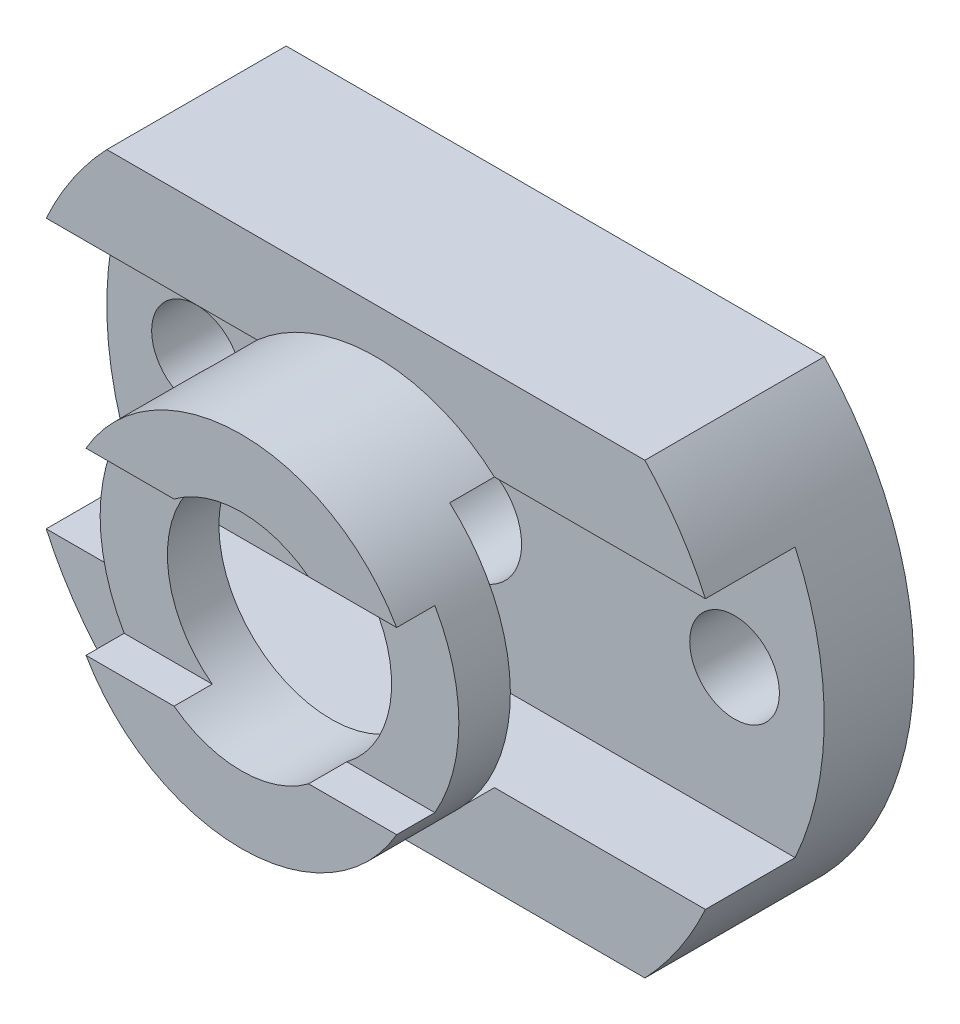
ISO-10303-21;
HEADER;
FILE_DESCRIPTION(('STEP AP214'),'2;1');
FILE_NAME('part.step','',(''),(''),'','','');
FILE_SCHEMA(('AUTOMOTIVE_DESIGN { 1 0 10303 214 1 1 1 1 }'));
ENDSEC;
DATA;
#1=APPLICATION_CONTEXT('core data for automotive mechanical design processes');
#2=APPLICATION_PROTOCOL_DEFINITION('international standard','automotive_design',2000,#1);
#3=PRODUCT_CONTEXT('',#1,'mechanical');
#4=PRODUCT('Part','Part','',(#3));
#5=PRODUCT_RELATED_PRODUCT_CATEGORY('part','',(#4));
#6=PRODUCT_DEFINITION_FORMATION('','',#4);
#7=PRODUCT_DEFINITION_CONTEXT('part definition',#1,'design');
#8=PRODUCT_DEFINITION('design','',#6,#7);
#9=PRODUCT_DEFINITION_SHAPE('','',#8);
#10=(LENGTH_UNIT() NAMED_UNIT(*) SI_UNIT(.MILLI.,.METRE.));
#11=(NAMED_UNIT(*) PLANE_ANGLE_UNIT() SI_UNIT($,.RADIAN.));
#12=(NAMED_UNIT(*) SI_UNIT($,.STERADIAN.) SOLID_ANGLE_UNIT());
#13=UNCERTAINTY_MEASURE_WITH_UNIT(LENGTH_MEASURE(1.E-05),#10,'distance_accuracy_value','');
#14=(GEOMETRIC_REPRESENTATION_CONTEXT(3) GLOBAL_UNCERTAINTY_ASSIGNED_CONTEXT((#13)) GLOBAL_UNIT_ASSIGNED_CONTEXT((#10,
#11,#12)) REPRESENTATION_CONTEXT('',''));
#15=CARTESIAN_POINT('',(0.,0.,0.));
#16=DIRECTION('',(0.,0.,1.));
#17=DIRECTION('',(1.,0.,0.));
#18=AXIS2_PLACEMENT_3D('',#15,#16,#17);
#19=CARTESIAN_POINT('',(-8.,2.,6.14851959349518));
#20=DIRECTION('',(0.,0.,-1.));
#21=DIRECTION('',(-1.,0.,0.));
#22=AXIS2_PLACEMENT_3D('',#19,#20,#21);
#23=PLANE('',#22);
#24=CARTESIAN_POINT('',(0.,0.,6.14851959349518));
#25=DIRECTION('',(0.,0.,-1.));
#26=DIRECTION('',(-1.,0.,0.));
#27=AXIS2_PLACEMENT_3D('',#24,#25,#26);
#28=CIRCLE('',#27,2.5);
#29=CARTESIAN_POINT('',(1.5,-2.,6.14851959349518));
#30=VERTEX_POINT('',#29);
#31=CARTESIAN_POINT('',(1.5,2.,6.14851959349518));
#32=VERTEX_POINT('',#31);
#33=EDGE_CURVE('E218',#30,#32,#28,.F.);
#34=ORIENTED_EDGE('',*,*,#33,.F.);
#35=DIRECTION('',(1.,0.,0.));
#36=VECTOR('',#35,1.);
#37=CARTESIAN_POINT('',(-8.,-2.,6.14851959349518));
#38=LINE('',#37,#36);
#39=CARTESIAN_POINT('',(3.46410161513775,-2.,6.14851959349518));
#40=VERTEX_POINT('',#39);
#41=EDGE_CURVE('E227',#30,#40,#38,.T.);
#42=ORIENTED_EDGE('',*,*,#41,.T.);
#43=CARTESIAN_POINT('',(0.,0.,6.14851959349518));
#44=DIRECTION('',(0.,0.,-1.));
#45=DIRECTION('',(-1.,0.,0.));
#46=AXIS2_PLACEMENT_3D('',#43,#44,#45);
#47=CIRCLE('',#46,4.);
#48=CARTESIAN_POINT('',(3.46410161513775,2.,6.14851959349518));
#49=VERTEX_POINT('',#48);
#50=EDGE_CURVE('E355',#40,#49,#47,.F.);
#51=ORIENTED_EDGE('',*,*,#50,.T.);
#52=DIRECTION('',(1.,0.,0.));
#53=VECTOR('',#52,1.);
#54=CARTESIAN_POINT('',(-8.,2.,6.14851959349518));
#55=LINE('',#54,#53);
#56=EDGE_CURVE('E229',#32,#49,#55,.T.);
#57=ORIENTED_EDGE('',*,*,#56,.F.);
#58=EDGE_LOOP('',(#34,#42,#51,#57));
#59=FACE_BOUND('',#58,.T.);
#60=ADVANCED_FACE('F81',(#59),#23,.F.);
#61=CARTESIAN_POINT('',(-8.,2.,7.));
#62=DIRECTION('',(0.,1.,0.));
#63=DIRECTION('',(0.,0.,1.));
#64=AXIS2_PLACEMENT_3D('',#61,#62,#63);
#65=PLANE('',#64);
#66=DIRECTION('',(0.,0.,-1.));
#67=VECTOR('',#66,1.);
#68=CARTESIAN_POINT('',(1.5,2.,7.14851959349518));
#69=LINE('',#68,#67);
#70=CARTESIAN_POINT('',(1.5,2.,7.));
#71=VERTEX_POINT('',#70);
#72=EDGE_CURVE('E383',#32,#71,#69,.F.);
#73=ORIENTED_EDGE('',*,*,#72,.F.);
#74=ORIENTED_EDGE('',*,*,#56,.T.);
#75=DIRECTION('',(0.,0.,1.));
#76=VECTOR('',#75,1.);
#77=CARTESIAN_POINT('',(3.46410161513775,2.,4.));
#78=LINE('',#77,#76);
#79=CARTESIAN_POINT('',(3.46410161513775,2.,7.));
#80=VERTEX_POINT('',#79);
#81=EDGE_CURVE('E223',#49,#80,#78,.T.);
#82=ORIENTED_EDGE('',*,*,#81,.T.);
#83=DIRECTION('',(1.,0.,0.));
#84=VECTOR('',#83,1.);
#85=CARTESIAN_POINT('',(-8.,2.,7.));
#86=LINE('',#85,#84);
#87=EDGE_CURVE('E373',#71,#80,#86,.T.);
#88=ORIENTED_EDGE('',*,*,#87,.F.);
#89=EDGE_LOOP('',(#73,#74,#82,#88));
#90=FACE_BOUND('',#89,.T.);
#91=ADVANCED_FACE('F410',(#90),#65,.F.);
#92=DIRECTION('',(0.,0.,-1.));
#93=VECTOR('',#92,1.);
#94=CARTESIAN_POINT('',(-1.5,2.,7.14851959349518));
#95=LINE('',#94,#93);
#96=CARTESIAN_POINT('',(-1.5,2.,7.));
#97=VERTEX_POINT('',#96);
#98=CARTESIAN_POINT('',(-1.5,2.,6.14851959349518));
#99=VERTEX_POINT('',#98);
#100=EDGE_CURVE('E380',#97,#99,#95,.T.);
#101=ORIENTED_EDGE('',*,*,#100,.F.);
#102=CARTESIAN_POINT('',(-3.46410161513775,2.,7.));
#103=VERTEX_POINT('',#102);
#104=EDGE_CURVE('E372',#103,#97,#86,.T.);
#105=ORIENTED_EDGE('',*,*,#104,.F.);
#106=DIRECTION('',(0.,0.,1.));
#107=VECTOR('',#106,1.);
#108=CARTESIAN_POINT('',(-3.46410161513775,2.,4.));
#109=LINE('',#108,#107);
#110=CARTESIAN_POINT('',(-3.46410161513775,2.,6.14851959349518));
#111=VERTEX_POINT('',#110);
#112=EDGE_CURVE('E354',#103,#111,#109,.F.);
#113=ORIENTED_EDGE('',*,*,#112,.T.);
#114=EDGE_CURVE('E242',#111,#99,#55,.T.);
#115=ORIENTED_EDGE('',*,*,#114,.T.);
#116=EDGE_LOOP('',(#101,#105,#113,#115));
#117=FACE_BOUND('',#116,.T.);
#118=ADVANCED_FACE('F416',(#117),#65,.F.);
#119=CARTESIAN_POINT('',(-8.,-2.,7.));
#120=DIRECTION('',(0.,-1.,0.));
#121=DIRECTION('',(0.,0.,-1.));
#122=AXIS2_PLACEMENT_3D('',#119,#120,#121);
#123=PLANE('',#122);
#124=DIRECTION('',(0.,0.,-1.));
#125=VECTOR('',#124,1.);
#126=CARTESIAN_POINT('',(-1.5,-2.,7.14851959349518));
#127=LINE('',#126,#125);
#128=CARTESIAN_POINT('',(-1.5,-2.,6.14851959349518));
#129=VERTEX_POINT('',#128);
#130=CARTESIAN_POINT('',(-1.5,-2.,7.));
#131=VERTEX_POINT('',#130);
#132=EDGE_CURVE('E12',#129,#131,#127,.F.);
#133=ORIENTED_EDGE('',*,*,#132,.F.);
#134=CARTESIAN_POINT('',(-3.46410161513775,-2.,6.14851959349518));
#135=VERTEX_POINT('',#134);
#136=EDGE_CURVE('E103',#135,#129,#38,.T.);
#137=ORIENTED_EDGE('',*,*,#136,.F.);
#138=DIRECTION('',(0.,0.,1.));
#139=VECTOR('',#138,1.);
#140=CARTESIAN_POINT('',(-3.46410161513775,-2.,4.));
#141=LINE('',#140,#139);
#142=CARTESIAN_POINT('',(-3.46410161513775,-2.,7.));
#143=VERTEX_POINT('',#142);
#144=EDGE_CURVE('E350',#135,#143,#141,.T.);
#145=ORIENTED_EDGE('',*,*,#144,.T.);
#146=DIRECTION('',(1.,0.,0.));
#147=VECTOR('',#146,1.);
#148=CARTESIAN_POINT('',(-8.,-2.,7.));
#149=LINE('',#148,#147);
#150=EDGE_CURVE('E236',#143,#131,#149,.T.);
#151=ORIENTED_EDGE('',*,*,#150,.T.);
#152=EDGE_LOOP('',(#133,#137,#145,#151));
#153=FACE_BOUND('',#152,.T.);
#154=ADVANCED_FACE('F389',(#153),#123,.F.);
#155=DIRECTION('',(0.,0.,-1.));
#156=VECTOR('',#155,1.);
#157=CARTESIAN_POINT('',(1.5,-2.,7.14851959349518));
#158=LINE('',#157,#156);
#159=CARTESIAN_POINT('',(1.49999999999999,-2.,7.));
#160=VERTEX_POINT('',#159);
#161=EDGE_CURVE('E89',#160,#30,#158,.T.);
#162=ORIENTED_EDGE('',*,*,#161,.F.);
#163=CARTESIAN_POINT('',(3.46410161513775,-2.,7.));
#164=VERTEX_POINT('',#163);
#165=EDGE_CURVE('E239',#160,#164,#149,.T.);
#166=ORIENTED_EDGE('',*,*,#165,.T.);
#167=DIRECTION('',(0.,0.,1.));
#168=VECTOR('',#167,1.);
#169=CARTESIAN_POINT('',(3.46410161513775,-2.,4.));
#170=LINE('',#169,#168);
#171=EDGE_CURVE('E234',#164,#40,#170,.F.);
#172=ORIENTED_EDGE('',*,*,#171,.T.);
#173=ORIENTED_EDGE('',*,*,#41,.F.);
#174=EDGE_LOOP('',(#162,#166,#172,#173));
#175=FACE_BOUND('',#174,.T.);
#176=ADVANCED_FACE('F232',(#175),#123,.F.);
#177=CARTESIAN_POINT('',(8.,4.,7.));
#178=DIRECTION('',(0.,0.,-1.));
#179=DIRECTION('',(-1.,0.,0.));
#180=AXIS2_PLACEMENT_3D('',#177,#178,#179);
#181=PLANE('',#180);
#182=CARTESIAN_POINT('',(0.,0.,7.));
#183=DIRECTION('',(0.,0.,-1.));
#184=DIRECTION('',(-1.,0.,0.));
#185=AXIS2_PLACEMENT_3D('',#182,#183,#184);
#186=CIRCLE('',#185,2.5);
#187=EDGE_CURVE('E374',#71,#97,#186,.F.);
#188=ORIENTED_EDGE('',*,*,#187,.F.);
#189=ORIENTED_EDGE('',*,*,#87,.T.);
#190=CARTESIAN_POINT('',(0.,0.,7.));
#191=DIRECTION('',(0.,0.,1.));
#192=DIRECTION('',(1.,0.,0.));
#193=AXIS2_PLACEMENT_3D('',#190,#191,#192);
#194=CIRCLE('',#193,4.);
#195=EDGE_CURVE('E249',#80,#103,#194,.T.);
#196=ORIENTED_EDGE('',*,*,#195,.T.);
#197=ORIENTED_EDGE('',*,*,#104,.T.);
#198=EDGE_LOOP('',(#188,#189,#196,#197));
#199=FACE_BOUND('',#198,.T.);
#200=ADVANCED_FACE('F371',(#199),#181,.F.);
#201=CARTESIAN_POINT('',(0.,0.,7.));
#202=DIRECTION('',(0.,0.,-1.));
#203=DIRECTION('',(-1.,0.,0.));
#204=AXIS2_PLACEMENT_3D('',#201,#202,#203);
#205=CIRCLE('',#204,2.5);
#206=EDGE_CURVE('E95',#131,#160,#205,.F.);
#207=ORIENTED_EDGE('',*,*,#206,.F.);
#208=ORIENTED_EDGE('',*,*,#150,.F.);
#209=EDGE_CURVE('E252',#143,#164,#194,.T.);
#210=ORIENTED_EDGE('',*,*,#209,.T.);
#211=ORIENTED_EDGE('',*,*,#165,.F.);
#212=EDGE_LOOP('',(#207,#208,#210,#211));
#213=FACE_BOUND('',#212,.T.);
#214=ADVANCED_FACE('F396',(#213),#181,.F.);
#215=CARTESIAN_POINT('',(8.,-3.,5.));
#216=DIRECTION('',(0.,0.,1.));
#217=DIRECTION('',(1.,0.,0.));
#218=AXIS2_PLACEMENT_3D('',#215,#216,#217);
#219=PLANE('',#218);
#220=CARTESIAN_POINT('',(0.,0.,5.));
#221=DIRECTION('',(0.,0.,1.));
#222=DIRECTION('',(1.,0.,0.));
#223=AXIS2_PLACEMENT_3D('',#220,#221,#222);
#224=CIRCLE('',#223,2.5);
#225=CARTESIAN_POINT('',(2.5,0.,5.));
#226=VERTEX_POINT('',#225);
#227=EDGE_CURVE('E377',#226,#226,#224,.F.);
#228=ORIENTED_EDGE('',*,*,#227,.F.);
#229=EDGE_LOOP('',(#228));
#230=FACE_BOUND('',#229,.T.);
#231=CARTESIAN_POINT('',(0.,0.,5.));
#232=DIRECTION('',(0.,0.,1.));
#233=DIRECTION('',(1.,0.,0.));
#234=AXIS2_PLACEMENT_3D('',#231,#232,#233);
#235=CIRCLE('',#234,4.);
#236=CARTESIAN_POINT('',(-2.64575131106459,3.,5.));
#237=VERTEX_POINT('',#236);
#238=CARTESIAN_POINT('',(-2.64575131106459,-3.,5.));
#239=VERTEX_POINT('',#238);
#240=EDGE_CURVE('E263',#237,#239,#235,.T.);
#241=ORIENTED_EDGE('',*,*,#240,.F.);
#242=DIRECTION('',(-1.,0.,0.));
#243=VECTOR('',#242,1.);
#244=CARTESIAN_POINT('',(8.,3.,5.));
#245=LINE('',#244,#243);
#246=CARTESIAN_POINT('',(2.64575131106459,3.,5.));
#247=VERTEX_POINT('',#246);
#248=EDGE_CURVE('E312',#247,#237,#245,.T.);
#249=ORIENTED_EDGE('',*,*,#248,.F.);
#250=CARTESIAN_POINT('',(2.64575131106459,-3.,5.));
#251=VERTEX_POINT('',#250);
#252=EDGE_CURVE('E260',#251,#247,#235,.T.);
#253=ORIENTED_EDGE('',*,*,#252,.F.);
#254=DIRECTION('',(-1.,0.,0.));
#255=VECTOR('',#254,1.);
#256=CARTESIAN_POINT('',(8.,-3.,5.));
#257=LINE('',#256,#255);
#258=EDGE_CURVE('E313',#251,#239,#257,.T.);
#259=ORIENTED_EDGE('',*,*,#258,.T.);
#260=EDGE_LOOP('',(#241,#249,#253,#259));
#261=FACE_BOUND('',#260,.T.);
#262=ADVANCED_FACE('F398',(#230,#261),#219,.F.);
#263=CARTESIAN_POINT('',(8.,-3.,5.));
#264=DIRECTION('',(0.,-1.,0.));
#265=DIRECTION('',(0.,0.,-1.));
#266=AXIS2_PLACEMENT_3D('',#263,#264,#265);
#267=PLANE('',#266);
#268=DIRECTION('',(-1.,0.,0.));
#269=VECTOR('',#268,1.);
#270=CARTESIAN_POINT('',(8.,-3.,4.));
#271=LINE('',#270,#269);
#272=CARTESIAN_POINT('',(7.35018939122204,-3.,4.));
#273=VERTEX_POINT('',#272);
#274=CARTESIAN_POINT('',(2.64575131106459,-3.,4.));
#275=VERTEX_POINT('',#274);
#276=EDGE_CURVE('E247',#273,#275,#271,.T.);
#277=ORIENTED_EDGE('',*,*,#276,.F.);
#278=DIRECTION('',(0.,0.,1.));
#279=VECTOR('',#278,1.);
#280=CARTESIAN_POINT('',(7.35018939122204,-3.,-9.));
#281=LINE('',#280,#279);
#282=CARTESIAN_POINT('',(7.35018939122204,-3.,2.));
#283=VERTEX_POINT('',#282);
#284=EDGE_CURVE('E305',#273,#283,#281,.F.);
#285=ORIENTED_EDGE('',*,*,#284,.T.);
#286=DIRECTION('',(-1.,0.,0.));
#287=VECTOR('',#286,1.);
#288=CARTESIAN_POINT('',(8.,-3.,2.));
#289=LINE('',#288,#287);
#290=CARTESIAN_POINT('',(-7.3501929237508,-3.,2.));
#291=VERTEX_POINT('',#290);
#292=EDGE_CURVE('E317',#283,#291,#289,.T.);
#293=ORIENTED_EDGE('',*,*,#292,.T.);
#294=DIRECTION('',(0.,0.,1.));
#295=VECTOR('',#294,1.);
#296=CARTESIAN_POINT('',(-7.3501929237508,-3.,-9.));
#297=LINE('',#296,#295);
#298=CARTESIAN_POINT('',(-7.3501929237508,-3.,4.));
#299=VERTEX_POINT('',#298);
#300=EDGE_CURVE('E338',#299,#291,#297,.F.);
#301=ORIENTED_EDGE('',*,*,#300,.F.);
#302=CARTESIAN_POINT('',(-2.64575131106459,-3.,4.));
#303=VERTEX_POINT('',#302);
#304=EDGE_CURVE('E256',#303,#299,#271,.T.);
#305=ORIENTED_EDGE('',*,*,#304,.F.);
#306=DIRECTION('',(0.,0.,1.));
#307=VECTOR('',#306,1.);
#308=CARTESIAN_POINT('',(-2.64575131106459,-3.,4.));
#309=LINE('',#308,#307);
#310=EDGE_CURVE('E265',#239,#303,#309,.F.);
#311=ORIENTED_EDGE('',*,*,#310,.F.);
#312=ORIENTED_EDGE('',*,*,#258,.F.);
#313=DIRECTION('',(0.,0.,1.));
#314=VECTOR('',#313,1.);
#315=CARTESIAN_POINT('',(2.64575131106459,-3.,4.));
#316=LINE('',#315,#314);
#317=EDGE_CURVE('E262',#275,#251,#316,.T.);
#318=ORIENTED_EDGE('',*,*,#317,.F.);
#319=EDGE_LOOP('',(#277,#285,#293,#301,#305,#311,#312,#318));
#320=FACE_BOUND('',#319,.T.);
#321=ADVANCED_FACE('F404',(#320),#267,.F.);
#322=CARTESIAN_POINT('',(8.,3.,5.));
#323=DIRECTION('',(0.,1.,0.));
#324=DIRECTION('',(0.,0.,1.));
#325=AXIS2_PLACEMENT_3D('',#322,#323,#324);
#326=PLANE('',#325);
#327=DIRECTION('',(1.,0.,0.));
#328=VECTOR('',#327,1.);
#329=CARTESIAN_POINT('',(8.,3.,4.));
#330=LINE('',#329,#328);
#331=CARTESIAN_POINT('',(-7.3501929237508,3.,4.));
#332=VERTEX_POINT('',#331);
#333=CARTESIAN_POINT('',(-2.64575131106459,3.,4.));
#334=VERTEX_POINT('',#333);
#335=EDGE_CURVE('E259',#332,#334,#330,.T.);
#336=ORIENTED_EDGE('',*,*,#335,.F.);
#337=DIRECTION('',(0.,0.,1.));
#338=VECTOR('',#337,1.);
#339=CARTESIAN_POINT('',(-7.3501929237508,2.99999999999999,-9.));
#340=LINE('',#339,#338);
#341=CARTESIAN_POINT('',(-7.3501929237508,3.,2.));
#342=VERTEX_POINT('',#341);
#343=EDGE_CURVE('E333',#342,#332,#340,.T.);
#344=ORIENTED_EDGE('',*,*,#343,.F.);
#345=DIRECTION('',(-1.,0.,0.));
#346=VECTOR('',#345,1.);
#347=CARTESIAN_POINT('',(8.,3.,2.));
#348=LINE('',#347,#346);
#349=CARTESIAN_POINT('',(7.35018939122204,2.99999999999999,2.));
#350=VERTEX_POINT('',#349);
#351=EDGE_CURVE('E320',#350,#342,#348,.T.);
#352=ORIENTED_EDGE('',*,*,#351,.F.);
#353=DIRECTION('',(0.,0.,1.));
#354=VECTOR('',#353,1.);
#355=CARTESIAN_POINT('',(7.35018939122204,2.99999999999999,-9.));
#356=LINE('',#355,#354);
#357=CARTESIAN_POINT('',(7.35018939122204,2.99999999999999,4.));
#358=VERTEX_POINT('',#357);
#359=EDGE_CURVE('E273',#350,#358,#356,.T.);
#360=ORIENTED_EDGE('',*,*,#359,.T.);
#361=CARTESIAN_POINT('',(2.64575131106459,3.,4.));
#362=VERTEX_POINT('',#361);
#363=EDGE_CURVE('E255',#362,#358,#330,.T.);
#364=ORIENTED_EDGE('',*,*,#363,.F.);
#365=DIRECTION('',(0.,0.,1.));
#366=VECTOR('',#365,1.);
#367=CARTESIAN_POINT('',(2.64575131106459,3.,4.));
#368=LINE('',#367,#366);
#369=EDGE_CURVE('E340',#247,#362,#368,.F.);
#370=ORIENTED_EDGE('',*,*,#369,.F.);
#371=ORIENTED_EDGE('',*,*,#248,.T.);
#372=DIRECTION('',(0.,0.,1.));
#373=VECTOR('',#372,1.);
#374=CARTESIAN_POINT('',(-2.64575131106459,3.,4.));
#375=LINE('',#374,#373);
#376=EDGE_CURVE('E348',#334,#237,#375,.T.);
#377=ORIENTED_EDGE('',*,*,#376,.F.);
#378=EDGE_LOOP('',(#336,#344,#352,#360,#364,#370,#371,#377));
#379=FACE_BOUND('',#378,.T.);
#380=ADVANCED_FACE('F447',(#379),#326,.F.);
#381=CARTESIAN_POINT('',(-0.750017268173042,0.,-9.));
#382=DIRECTION('',(0.,0.,1.));
#383=DIRECTION('',(1.,0.,0.));
#384=AXIS2_PLACEMENT_3D('',#381,#382,#383);
#385=CYLINDRICAL_SURFACE('',#384,7.24998749547068);
#386=CARTESIAN_POINT('',(-0.750017268173042,0.,4.));
#387=DIRECTION('',(0.,0.,-1.));
#388=DIRECTION('',(-1.,0.,0.));
#389=AXIS2_PLACEMENT_3D('',#386,#387,#388);
#390=CIRCLE('',#389,7.24998749547068);
#391=CARTESIAN_POINT('',(-6.,-5.,4.));
#392=VERTEX_POINT('',#391);
#393=EDGE_CURVE('E271',#392,#299,#390,.T.);
#394=ORIENTED_EDGE('',*,*,#393,.T.);
#395=ORIENTED_EDGE('',*,*,#300,.T.);
#396=CARTESIAN_POINT('',(-0.750017268173042,0.,2.));
#397=DIRECTION('',(0.,0.,-1.));
#398=DIRECTION('',(-1.,0.,0.));
#399=AXIS2_PLACEMENT_3D('',#396,#397,#398);
#400=CIRCLE('',#399,7.24998749547068);
#401=EDGE_CURVE('E295',#291,#342,#400,.T.);
#402=ORIENTED_EDGE('',*,*,#401,.T.);
#403=ORIENTED_EDGE('',*,*,#343,.T.);
#404=CARTESIAN_POINT('',(-0.750017268173042,0.,4.00000000000001));
#405=DIRECTION('',(0.,0.,-1.));
#406=DIRECTION('',(-1.,0.,0.));
#407=AXIS2_PLACEMENT_3D('',#404,#405,#406);
#408=CIRCLE('',#407,7.24998749547068);
#409=CARTESIAN_POINT('',(-6.,5.,4.00000000000001));
#410=VERTEX_POINT('',#409);
#411=EDGE_CURVE('E300',#332,#410,#408,.T.);
#412=ORIENTED_EDGE('',*,*,#411,.T.);
#413=DIRECTION('',(0.,0.,1.));
#414=VECTOR('',#413,1.);
#415=CARTESIAN_POINT('',(-6.,5.,-9.));
#416=LINE('',#415,#414);
#417=CARTESIAN_POINT('',(-6.,5.,0.));
#418=VERTEX_POINT('',#417);
#419=EDGE_CURVE('E292',#418,#410,#416,.T.);
#420=ORIENTED_EDGE('',*,*,#419,.F.);
#421=CARTESIAN_POINT('',(-0.750017268173042,0.,0.));
#422=DIRECTION('',(0.,0.,1.));
#423=DIRECTION('',(1.,0.,0.));
#424=AXIS2_PLACEMENT_3D('',#421,#422,#423);
#425=CIRCLE('',#424,7.24998749547068);
#426=CARTESIAN_POINT('',(-6.,-5.,0.));
#427=VERTEX_POINT('',#426);
#428=EDGE_CURVE('E303',#418,#427,#425,.T.);
#429=ORIENTED_EDGE('',*,*,#428,.T.);
#430=DIRECTION('',(0.,0.,1.));
#431=VECTOR('',#430,1.);
#432=CARTESIAN_POINT('',(-6.,-5.,-9.));
#433=LINE('',#432,#431);
#434=EDGE_CURVE('E269',#427,#392,#433,.T.);
#435=ORIENTED_EDGE('',*,*,#434,.T.);
#436=EDGE_LOOP('',(#394,#395,#402,#403,#412,#420,#429,#435));
#437=FACE_BOUND('',#436,.T.);
#438=ADVANCED_FACE('F443',(#437),#385,.T.);
#439=CARTESIAN_POINT('',(0.750000000000002,0.,-9.));
#440=DIRECTION('',(0.,0.,1.));
#441=DIRECTION('',(1.,0.,0.));
#442=AXIS2_PLACEMENT_3D('',#439,#440,#441);
#443=CYLINDRICAL_SURFACE('',#442,7.25);
#444=CARTESIAN_POINT('',(0.750000000000002,0.,4.00000000000001));
#445=DIRECTION('',(0.,0.,-1.));
#446=DIRECTION('',(-1.,0.,0.));
#447=AXIS2_PLACEMENT_3D('',#444,#445,#446);
#448=CIRCLE('',#447,7.25);
#449=CARTESIAN_POINT('',(6.,5.,4.00000000000001));
#450=VERTEX_POINT('',#449);
#451=EDGE_CURVE('E276',#358,#450,#448,.F.);
#452=ORIENTED_EDGE('',*,*,#451,.F.);
#453=ORIENTED_EDGE('',*,*,#359,.F.);
#454=CARTESIAN_POINT('',(0.750000000000002,0.,2.));
#455=DIRECTION('',(0.,0.,-1.));
#456=DIRECTION('',(-1.,0.,0.));
#457=AXIS2_PLACEMENT_3D('',#454,#455,#456);
#458=CIRCLE('',#457,7.25);
#459=EDGE_CURVE('E336',#283,#350,#458,.F.);
#460=ORIENTED_EDGE('',*,*,#459,.F.);
#461=ORIENTED_EDGE('',*,*,#284,.F.);
#462=CARTESIAN_POINT('',(0.750000000000002,0.,4.));
#463=DIRECTION('',(0.,0.,-1.));
#464=DIRECTION('',(-1.,0.,0.));
#465=AXIS2_PLACEMENT_3D('',#462,#463,#464);
#466=CIRCLE('',#465,7.25);
#467=CARTESIAN_POINT('',(6.,-5.,4.));
#468=VERTEX_POINT('',#467);
#469=EDGE_CURVE('E307',#468,#273,#466,.F.);
#470=ORIENTED_EDGE('',*,*,#469,.F.);
#471=DIRECTION('',(0.,0.,1.));
#472=VECTOR('',#471,1.);
#473=CARTESIAN_POINT('',(6.,-5.,-9.));
#474=LINE('',#473,#472);
#475=CARTESIAN_POINT('',(6.,-5.,0.));
#476=VERTEX_POINT('',#475);
#477=EDGE_CURVE('E291',#476,#468,#474,.T.);
#478=ORIENTED_EDGE('',*,*,#477,.F.);
#479=CARTESIAN_POINT('',(0.750000000000002,0.,0.));
#480=DIRECTION('',(0.,0.,1.));
#481=DIRECTION('',(1.,0.,0.));
#482=AXIS2_PLACEMENT_3D('',#479,#480,#481);
#483=CIRCLE('',#482,7.25);
#484=CARTESIAN_POINT('',(6.,5.,0.));
#485=VERTEX_POINT('',#484);
#486=EDGE_CURVE('E309',#485,#476,#483,.F.);
#487=ORIENTED_EDGE('',*,*,#486,.F.);
#488=DIRECTION('',(0.,0.,1.));
#489=VECTOR('',#488,1.);
#490=CARTESIAN_POINT('',(6.,5.,-9.));
#491=LINE('',#490,#489);
#492=EDGE_CURVE('E267',#485,#450,#491,.T.);
#493=ORIENTED_EDGE('',*,*,#492,.T.);
#494=EDGE_LOOP('',(#452,#453,#460,#461,#470,#478,#487,#493));
#495=FACE_BOUND('',#494,.T.);
#496=ADVANCED_FACE('F446',(#495),#443,.T.);
#497=CARTESIAN_POINT('',(8.,-5.,0.));
#498=DIRECTION('',(0.,0.,1.));
#499=DIRECTION('',(1.,0.,0.));
#500=AXIS2_PLACEMENT_3D('',#497,#498,#499);
#501=PLANE('',#500);
#502=CARTESIAN_POINT('',(6.,0.,0.));
#503=DIRECTION('',(0.,0.,1.));
#504=DIRECTION('',(1.,0.,0.));
#505=AXIS2_PLACEMENT_3D('',#502,#503,#504);
#506=CIRCLE('',#505,1.);
#507=CARTESIAN_POINT('',(7.,0.,0.));
#508=VERTEX_POINT('',#507);
#509=EDGE_CURVE('E288',#508,#508,#506,.T.);
#510=ORIENTED_EDGE('',*,*,#509,.T.);
#511=EDGE_LOOP('',(#510));
#512=FACE_BOUND('',#511,.T.);
#513=CARTESIAN_POINT('',(0.,0.,0.));
#514=DIRECTION('',(0.,0.,1.));
#515=DIRECTION('',(1.,0.,0.));
#516=AXIS2_PLACEMENT_3D('',#513,#514,#515);
#517=CIRCLE('',#516,1.25);
#518=CARTESIAN_POINT('',(1.25,0.,0.));
#519=VERTEX_POINT('',#518);
#520=EDGE_CURVE('E284',#519,#519,#517,.T.);
#521=ORIENTED_EDGE('',*,*,#520,.T.);
#522=EDGE_LOOP('',(#521));
#523=FACE_BOUND('',#522,.T.);
#524=CARTESIAN_POINT('',(-6.,0.,0.));
#525=DIRECTION('',(0.,0.,1.));
#526=DIRECTION('',(1.,0.,0.));
#527=AXIS2_PLACEMENT_3D('',#524,#525,#526);
#528=CIRCLE('',#527,1.);
#529=CARTESIAN_POINT('',(-5.,0.,0.));
#530=VERTEX_POINT('',#529);
#531=EDGE_CURVE('E280',#530,#530,#528,.T.);
#532=ORIENTED_EDGE('',*,*,#531,.T.);
#533=EDGE_LOOP('',(#532));
#534=FACE_BOUND('',#533,.T.);
#535=DIRECTION('',(-1.,0.,0.));
#536=VECTOR('',#535,1.);
#537=CARTESIAN_POINT('',(8.,5.,0.));
#538=LINE('',#537,#536);
#539=EDGE_CURVE('E328',#485,#418,#538,.T.);
#540=ORIENTED_EDGE('',*,*,#539,.F.);
#541=ORIENTED_EDGE('',*,*,#486,.T.);
#542=DIRECTION('',(-1.,0.,0.));
#543=VECTOR('',#542,1.);
#544=CARTESIAN_POINT('',(8.,-5.,0.));
#545=LINE('',#544,#543);
#546=EDGE_CURVE('E330',#476,#427,#545,.T.);
#547=ORIENTED_EDGE('',*,*,#546,.T.);
#548=ORIENTED_EDGE('',*,*,#428,.F.);
#549=EDGE_LOOP('',(#540,#541,#547,#548));
#550=FACE_BOUND('',#549,.T.);
#551=ADVANCED_FACE('F451',(#512,#523,#534,#550),#501,.F.);
#552=CARTESIAN_POINT('',(8.,-5.,4.));
#553=DIRECTION('',(0.,0.,-1.));
#554=DIRECTION('',(-1.,0.,0.));
#555=AXIS2_PLACEMENT_3D('',#552,#553,#554);
#556=PLANE('',#555);
#557=ORIENTED_EDGE('',*,*,#393,.F.);
#558=DIRECTION('',(-1.,0.,0.));
#559=VECTOR('',#558,1.);
#560=CARTESIAN_POINT('',(8.,-5.,4.));
#561=LINE('',#560,#559);
#562=EDGE_CURVE('E316',#468,#392,#561,.T.);
#563=ORIENTED_EDGE('',*,*,#562,.F.);
#564=ORIENTED_EDGE('',*,*,#469,.T.);
#565=ORIENTED_EDGE('',*,*,#276,.T.);
#566=CARTESIAN_POINT('',(0.,0.,4.));
#567=DIRECTION('',(0.,0.,1.));
#568=DIRECTION('',(1.,0.,0.));
#569=AXIS2_PLACEMENT_3D('',#566,#567,#568);
#570=CIRCLE('',#569,4.);
#571=EDGE_CURVE('E248',#303,#275,#570,.T.);
#572=ORIENTED_EDGE('',*,*,#571,.F.);
#573=ORIENTED_EDGE('',*,*,#304,.T.);
#574=EDGE_LOOP('',(#557,#563,#564,#565,#572,#573));
#575=FACE_BOUND('',#574,.T.);
#576=ADVANCED_FACE('F459',(#575),#556,.F.);
#577=CARTESIAN_POINT('',(8.,-3.,2.));
#578=DIRECTION('',(0.,0.,-1.));
#579=DIRECTION('',(-1.,0.,0.));
#580=AXIS2_PLACEMENT_3D('',#577,#578,#579);
#581=PLANE('',#580);
#582=CARTESIAN_POINT('',(6.,0.,2.));
#583=DIRECTION('',(0.,0.,-1.));
#584=DIRECTION('',(-1.,0.,0.));
#585=AXIS2_PLACEMENT_3D('',#582,#583,#584);
#586=CIRCLE('',#585,1.);
#587=CARTESIAN_POINT('',(5.,0.,2.));
#588=VERTEX_POINT('',#587);
#589=EDGE_CURVE('E287',#588,#588,#586,.T.);
#590=ORIENTED_EDGE('',*,*,#589,.T.);
#591=EDGE_LOOP('',(#590));
#592=FACE_BOUND('',#591,.T.);
#593=CARTESIAN_POINT('',(0.,0.,2.));
#594=DIRECTION('',(0.,0.,-1.));
#595=DIRECTION('',(-1.,0.,0.));
#596=AXIS2_PLACEMENT_3D('',#593,#594,#595);
#597=CIRCLE('',#596,1.25);
#598=CARTESIAN_POINT('',(-1.25,0.,2.));
#599=VERTEX_POINT('',#598);
#600=EDGE_CURVE('E283',#599,#599,#597,.T.);
#601=ORIENTED_EDGE('',*,*,#600,.T.);
#602=EDGE_LOOP('',(#601));
#603=FACE_BOUND('',#602,.T.);
#604=CARTESIAN_POINT('',(-6.,0.,2.));
#605=DIRECTION('',(0.,0.,-1.));
#606=DIRECTION('',(-1.,0.,0.));
#607=AXIS2_PLACEMENT_3D('',#604,#605,#606);
#608=CIRCLE('',#607,1.);
#609=CARTESIAN_POINT('',(-7.,0.,2.));
#610=VERTEX_POINT('',#609);
#611=EDGE_CURVE('E279',#610,#610,#608,.T.);
#612=ORIENTED_EDGE('',*,*,#611,.T.);
#613=EDGE_LOOP('',(#612));
#614=FACE_BOUND('',#613,.T.);
#615=ORIENTED_EDGE('',*,*,#459,.T.);
#616=ORIENTED_EDGE('',*,*,#351,.T.);
#617=ORIENTED_EDGE('',*,*,#401,.F.);
#618=ORIENTED_EDGE('',*,*,#292,.F.);
#619=EDGE_LOOP('',(#615,#616,#617,#618));
#620=FACE_BOUND('',#619,.T.);
#621=ADVANCED_FACE('F456',(#592,#603,#614,#620),#581,.F.);
#622=CARTESIAN_POINT('',(8.,-5.,0.));
#623=DIRECTION('',(0.,1.,0.));
#624=DIRECTION('',(0.,0.,1.));
#625=AXIS2_PLACEMENT_3D('',#622,#623,#624);
#626=PLANE('',#625);
#627=ORIENTED_EDGE('',*,*,#434,.F.);
#628=ORIENTED_EDGE('',*,*,#546,.F.);
#629=ORIENTED_EDGE('',*,*,#477,.T.);
#630=ORIENTED_EDGE('',*,*,#562,.T.);
#631=EDGE_LOOP('',(#627,#628,#629,#630));
#632=FACE_BOUND('',#631,.T.);
#633=ADVANCED_FACE('F83',(#632),#626,.F.);
#634=CARTESIAN_POINT('',(8.,5.,0.));
#635=DIRECTION('',(0.,-1.,0.));
#636=DIRECTION('',(0.,0.,-1.));
#637=AXIS2_PLACEMENT_3D('',#634,#635,#636);
#638=PLANE('',#637);
#639=DIRECTION('',(-1.,0.,0.));
#640=VECTOR('',#639,1.);
#641=CARTESIAN_POINT('',(8.,5.,4.00000000000001));
#642=LINE('',#641,#640);
#643=EDGE_CURVE('E326',#450,#410,#642,.T.);
#644=ORIENTED_EDGE('',*,*,#643,.F.);
#645=ORIENTED_EDGE('',*,*,#492,.F.);
#646=ORIENTED_EDGE('',*,*,#539,.T.);
#647=ORIENTED_EDGE('',*,*,#419,.T.);
#648=EDGE_LOOP('',(#644,#645,#646,#647));
#649=FACE_BOUND('',#648,.T.);
#650=ADVANCED_FACE('F487',(#649),#638,.F.);
#651=CARTESIAN_POINT('',(8.,4.,4.00000000000001));
#652=DIRECTION('',(0.,0.,-1.));
#653=DIRECTION('',(-1.,0.,0.));
#654=AXIS2_PLACEMENT_3D('',#651,#652,#653);
#655=PLANE('',#654);
#656=ORIENTED_EDGE('',*,*,#335,.T.);
#657=EDGE_CURVE('E245',#362,#334,#570,.T.);
#658=ORIENTED_EDGE('',*,*,#657,.F.);
#659=ORIENTED_EDGE('',*,*,#363,.T.);
#660=ORIENTED_EDGE('',*,*,#451,.T.);
#661=ORIENTED_EDGE('',*,*,#643,.T.);
#662=ORIENTED_EDGE('',*,*,#411,.F.);
#663=EDGE_LOOP('',(#656,#658,#659,#660,#661,#662));
#664=FACE_BOUND('',#663,.T.);
#665=ADVANCED_FACE('F438',(#664),#655,.F.);
#666=CARTESIAN_POINT('',(-6.,0.,-9.));
#667=DIRECTION('',(0.,0.,1.));
#668=DIRECTION('',(1.,0.,0.));
#669=AXIS2_PLACEMENT_3D('',#666,#667,#668);
#670=CYLINDRICAL_SURFACE('',#669,1.);
#671=ORIENTED_EDGE('',*,*,#611,.F.);
#672=EDGE_LOOP('',(#671));
#673=FACE_BOUND('',#672,.T.);
#674=ORIENTED_EDGE('',*,*,#531,.F.);
#675=EDGE_LOOP('',(#674));
#676=FACE_BOUND('',#675,.T.);
#677=ADVANCED_FACE('F435',(#673,#676),#670,.F.);
#678=CARTESIAN_POINT('',(0.,0.,-9.));
#679=DIRECTION('',(0.,0.,1.));
#680=DIRECTION('',(1.,0.,0.));
#681=AXIS2_PLACEMENT_3D('',#678,#679,#680);
#682=CYLINDRICAL_SURFACE('',#681,1.25);
#683=ORIENTED_EDGE('',*,*,#600,.F.);
#684=EDGE_LOOP('',(#683));
#685=FACE_BOUND('',#684,.T.);
#686=ORIENTED_EDGE('',*,*,#520,.F.);
#687=EDGE_LOOP('',(#686));
#688=FACE_BOUND('',#687,.T.);
#689=ADVANCED_FACE('F431',(#685,#688),#682,.F.);
#690=CARTESIAN_POINT('',(6.,0.,-9.));
#691=DIRECTION('',(0.,0.,1.));
#692=DIRECTION('',(1.,0.,0.));
#693=AXIS2_PLACEMENT_3D('',#690,#691,#692);
#694=CYLINDRICAL_SURFACE('',#693,1.);
#695=ORIENTED_EDGE('',*,*,#589,.F.);
#696=EDGE_LOOP('',(#695));
#697=FACE_BOUND('',#696,.T.);
#698=ORIENTED_EDGE('',*,*,#509,.F.);
#699=EDGE_LOOP('',(#698));
#700=FACE_BOUND('',#699,.T.);
#701=ADVANCED_FACE('F425',(#697,#700),#694,.F.);
#702=CARTESIAN_POINT('',(0.,0.,4.));
#703=DIRECTION('',(0.,0.,1.));
#704=DIRECTION('',(1.,0.,0.));
#705=AXIS2_PLACEMENT_3D('',#702,#703,#704);
#706=CYLINDRICAL_SURFACE('',#705,4.);
#707=ORIENTED_EDGE('',*,*,#81,.F.);
#708=ORIENTED_EDGE('',*,*,#50,.F.);
#709=ORIENTED_EDGE('',*,*,#171,.F.);
#710=ORIENTED_EDGE('',*,*,#209,.F.);
#711=ORIENTED_EDGE('',*,*,#144,.F.);
#712=EDGE_CURVE('E352',#111,#135,#47,.F.);
#713=ORIENTED_EDGE('',*,*,#712,.F.);
#714=ORIENTED_EDGE('',*,*,#112,.F.);
#715=ORIENTED_EDGE('',*,*,#195,.F.);
#716=EDGE_LOOP('',(#707,#708,#709,#710,#711,#713,#714,#715));
#717=FACE_BOUND('',#716,.T.);
#718=ORIENTED_EDGE('',*,*,#571,.T.);
#719=ORIENTED_EDGE('',*,*,#317,.T.);
#720=ORIENTED_EDGE('',*,*,#252,.T.);
#721=ORIENTED_EDGE('',*,*,#369,.T.);
#722=ORIENTED_EDGE('',*,*,#657,.T.);
#723=ORIENTED_EDGE('',*,*,#376,.T.);
#724=ORIENTED_EDGE('',*,*,#240,.T.);
#725=ORIENTED_EDGE('',*,*,#310,.T.);
#726=EDGE_LOOP('',(#718,#719,#720,#721,#722,#723,#724,#725));
#727=FACE_BOUND('',#726,.T.);
#728=ADVANCED_FACE('F364',(#717,#727),#706,.T.);
#729=EDGE_CURVE('E231',#99,#129,#28,.F.);
#730=ORIENTED_EDGE('',*,*,#729,.F.);
#731=ORIENTED_EDGE('',*,*,#114,.F.);
#732=ORIENTED_EDGE('',*,*,#712,.T.);
#733=ORIENTED_EDGE('',*,*,#136,.T.);
#734=EDGE_LOOP('',(#730,#731,#732,#733));
#735=FACE_BOUND('',#734,.T.);
#736=ADVANCED_FACE('F391',(#735),#23,.F.);
#737=CARTESIAN_POINT('',(0.,0.,7.14851959349518));
#738=DIRECTION('',(0.,0.,-1.));
#739=DIRECTION('',(-1.,0.,0.));
#740=AXIS2_PLACEMENT_3D('',#737,#738,#739);
#741=CYLINDRICAL_SURFACE('',#740,2.5);
#742=ORIENTED_EDGE('',*,*,#100,.T.);
#743=ORIENTED_EDGE('',*,*,#729,.T.);
#744=ORIENTED_EDGE('',*,*,#132,.T.);
#745=ORIENTED_EDGE('',*,*,#206,.T.);
#746=ORIENTED_EDGE('',*,*,#161,.T.);
#747=ORIENTED_EDGE('',*,*,#33,.T.);
#748=ORIENTED_EDGE('',*,*,#72,.T.);
#749=ORIENTED_EDGE('',*,*,#187,.T.);
#750=EDGE_LOOP('',(#742,#743,#744,#745,#746,#747,#748,#749));
#751=FACE_BOUND('',#750,.T.);
#752=ORIENTED_EDGE('',*,*,#227,.T.);
#753=EDGE_LOOP('',(#752));
#754=FACE_BOUND('',#753,.T.);
#755=ADVANCED_FACE('F216',(#751,#754),#741,.F.);
#756=CLOSED_SHELL('',(#60,#91,#118,#154,#176,#200,#214,#262,#321,#380,#438,#496,#551,#576,#621,
#633,#650,#665,#677,#689,#701,#728,#736,#755));
#757=MANIFOLD_SOLID_BREP('B2',#756);
#758=ADVANCED_BREP_SHAPE_REPRESENTATION('',(#18,#757),#14);
#759=SHAPE_DEFINITION_REPRESENTATION(#9,#758);
ENDSEC;
END-ISO-10303-21;
